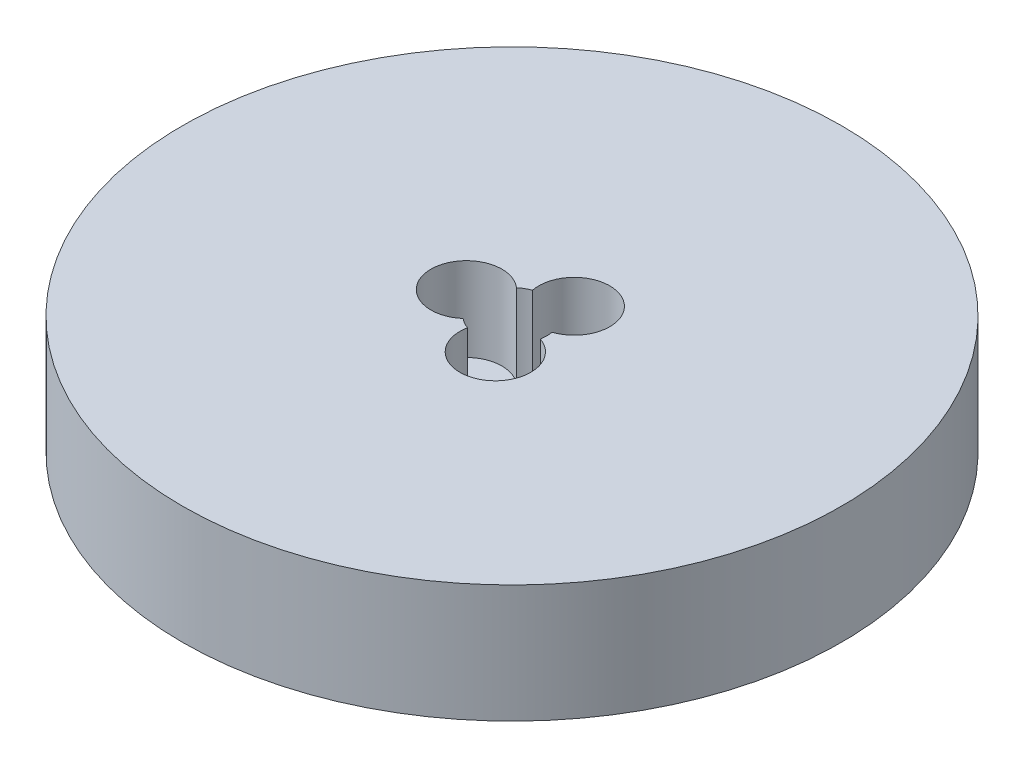
ISO-10303-21;
HEADER;
FILE_DESCRIPTION(('STEP AP214'),'2;1');
FILE_NAME('part.step','',(''),(''),'','','');
FILE_SCHEMA(('AUTOMOTIVE_DESIGN { 1 0 10303 214 1 1 1 1 }'));
ENDSEC;
DATA;
#1=APPLICATION_CONTEXT('core data for automotive mechanical design processes');
#2=APPLICATION_PROTOCOL_DEFINITION('international standard','automotive_design',2000,#1);
#3=PRODUCT_CONTEXT('',#1,'mechanical');
#4=PRODUCT('Part','Part','',(#3));
#5=PRODUCT_RELATED_PRODUCT_CATEGORY('part','',(#4));
#6=PRODUCT_DEFINITION_FORMATION('','',#4);
#7=PRODUCT_DEFINITION_CONTEXT('part definition',#1,'design');
#8=PRODUCT_DEFINITION('design','',#6,#7);
#9=PRODUCT_DEFINITION_SHAPE('','',#8);
#10=(LENGTH_UNIT() NAMED_UNIT(*) SI_UNIT(.MILLI.,.METRE.));
#11=(NAMED_UNIT(*) PLANE_ANGLE_UNIT() SI_UNIT($,.RADIAN.));
#12=(NAMED_UNIT(*) SI_UNIT($,.STERADIAN.) SOLID_ANGLE_UNIT());
#13=UNCERTAINTY_MEASURE_WITH_UNIT(LENGTH_MEASURE(1.E-05),#10,'distance_accuracy_value','');
#14=(GEOMETRIC_REPRESENTATION_CONTEXT(3) GLOBAL_UNCERTAINTY_ASSIGNED_CONTEXT((#13)) GLOBAL_UNIT_ASSIGNED_CONTEXT((#10,
#11,#12)) REPRESENTATION_CONTEXT('',''));
#15=CARTESIAN_POINT('',(0.,0.,0.));
#16=DIRECTION('',(0.,0.,1.));
#17=DIRECTION('',(1.,0.,0.));
#18=AXIS2_PLACEMENT_3D('',#15,#16,#17);
#19=CARTESIAN_POINT('',(0.,17.,0.));
#20=DIRECTION('',(0.,-1.,0.));
#21=DIRECTION('',(0.,0.,-1.));
#22=AXIS2_PLACEMENT_3D('',#19,#20,#21);
#23=CYLINDRICAL_SURFACE('',#22,47.5);
#24=CARTESIAN_POINT('',(0.,17.,0.));
#25=DIRECTION('',(0.,1.,0.));
#26=DIRECTION('',(0.,0.,1.));
#27=AXIS2_PLACEMENT_3D('',#24,#25,#26);
#28=CIRCLE('',#27,47.5);
#29=CARTESIAN_POINT('',(0.,17.,47.5));
#30=VERTEX_POINT('',#29);
#31=EDGE_CURVE('E126',#30,#30,#28,.T.);
#32=ORIENTED_EDGE('',*,*,#31,.F.);
#33=EDGE_LOOP('',(#32));
#34=FACE_BOUND('',#33,.T.);
#35=CARTESIAN_POINT('',(0.,0.,0.));
#36=DIRECTION('',(0.,1.,0.));
#37=DIRECTION('',(0.,0.,1.));
#38=AXIS2_PLACEMENT_3D('',#35,#36,#37);
#39=CIRCLE('',#38,47.5);
#40=CARTESIAN_POINT('',(0.,0.,47.5));
#41=VERTEX_POINT('',#40);
#42=EDGE_CURVE('E124',#41,#41,#39,.T.);
#43=ORIENTED_EDGE('',*,*,#42,.T.);
#44=EDGE_LOOP('',(#43));
#45=FACE_BOUND('',#44,.T.);
#46=ADVANCED_FACE('F39',(#34,#45),#23,.T.);
#47=CARTESIAN_POINT('',(0.,17.,0.));
#48=DIRECTION('',(0.,1.,0.));
#49=DIRECTION('',(0.,0.,1.));
#50=AXIS2_PLACEMENT_3D('',#47,#48,#49);
#51=PLANE('',#50);
#52=CARTESIAN_POINT('',(3.28463833537928,17.,5.68916048136531));
#53=DIRECTION('',(0.,1.,0.));
#54=DIRECTION('',(0.866025403784436,0.,-0.500000000000004));
#55=AXIS2_PLACEMENT_3D('',#52,#53,#54);
#56=CIRCLE('',#55,5.11395543585361);
#57=CARTESIAN_POINT('',(-1.73092532975813,17.,4.69083121661841));
#58=VERTEX_POINT('',#57);
#59=CARTESIAN_POINT('',(4.92784166333568,17.,0.846390300684663));
#60=VERTEX_POINT('',#59);
#61=EDGE_CURVE('E147',#58,#60,#56,.T.);
#62=ORIENTED_EDGE('',*,*,#61,.F.);
#63=CARTESIAN_POINT('',(0.,17.,0.));
#64=DIRECTION('',(0.,1.,0.));
#65=DIRECTION('',(0.,0.,1.));
#66=AXIS2_PLACEMENT_3D('',#63,#64,#65);
#67=CIRCLE('',#66,5.);
#68=CARTESIAN_POINT('',(-3.19691633357752,17.,3.84444091593371));
#69=VERTEX_POINT('',#68);
#70=EDGE_CURVE('E118',#69,#58,#67,.T.);
#71=ORIENTED_EDGE('',*,*,#70,.F.);
#72=CARTESIAN_POINT('',(-6.56927667075851,17.,0.));
#73=DIRECTION('',(0.,1.,0.));
#74=DIRECTION('',(0.,0.,1.));
#75=AXIS2_PLACEMENT_3D('',#72,#73,#74);
#76=CIRCLE('',#75,5.11395543585361);
#77=CARTESIAN_POINT('',(-3.19691633357752,17.,-3.84444091593371));
#78=VERTEX_POINT('',#77);
#79=EDGE_CURVE('E113',#78,#69,#76,.T.);
#80=ORIENTED_EDGE('',*,*,#79,.F.);
#81=CARTESIAN_POINT('',(-1.73092532975819,17.,-4.69083121661838));
#82=VERTEX_POINT('',#81);
#83=EDGE_CURVE('E106',#82,#78,#67,.T.);
#84=ORIENTED_EDGE('',*,*,#83,.F.);
#85=CARTESIAN_POINT('',(3.2846383353792,17.,-5.68916048136536));
#86=DIRECTION('',(0.,1.,0.));
#87=DIRECTION('',(-0.866025403784443,0.,-0.499999999999992));
#88=AXIS2_PLACEMENT_3D('',#85,#86,#87);
#89=CIRCLE('',#88,5.11395543585361);
#90=CARTESIAN_POINT('',(4.92784166333566,17.,-0.84639030068473));
#91=VERTEX_POINT('',#90);
#92=EDGE_CURVE('E90',#91,#82,#89,.T.);
#93=ORIENTED_EDGE('',*,*,#92,.F.);
#94=EDGE_CURVE('E116',#60,#91,#67,.T.);
#95=ORIENTED_EDGE('',*,*,#94,.F.);
#96=EDGE_LOOP('',(#62,#71,#80,#84,#93,#95));
#97=FACE_BOUND('',#96,.T.);
#98=ORIENTED_EDGE('',*,*,#31,.T.);
#99=EDGE_LOOP('',(#98));
#100=FACE_BOUND('',#99,.T.);
#101=ADVANCED_FACE('F115',(#97,#100),#51,.T.);
#102=CARTESIAN_POINT('',(0.,0.,0.));
#103=DIRECTION('',(0.,1.,0.));
#104=DIRECTION('',(0.,0.,1.));
#105=AXIS2_PLACEMENT_3D('',#102,#103,#104);
#106=PLANE('',#105);
#107=CARTESIAN_POINT('',(0.,0.,0.));
#108=DIRECTION('',(0.,1.,0.));
#109=DIRECTION('',(0.,0.,1.));
#110=AXIS2_PLACEMENT_3D('',#107,#108,#109);
#111=CIRCLE('',#110,5.);
#112=CARTESIAN_POINT('',(0.,0.,5.));
#113=VERTEX_POINT('',#112);
#114=EDGE_CURVE('E120',#113,#113,#111,.T.);
#115=ORIENTED_EDGE('',*,*,#114,.T.);
#116=EDGE_LOOP('',(#115));
#117=FACE_BOUND('',#116,.T.);
#118=ORIENTED_EDGE('',*,*,#42,.F.);
#119=EDGE_LOOP('',(#118));
#120=FACE_BOUND('',#119,.T.);
#121=ADVANCED_FACE('F164',(#117,#120),#106,.F.);
#122=CARTESIAN_POINT('',(0.,17.,0.));
#123=DIRECTION('',(0.,-1.,0.));
#124=DIRECTION('',(0.,0.,-1.));
#125=AXIS2_PLACEMENT_3D('',#122,#123,#124);
#126=CYLINDRICAL_SURFACE('',#125,5.);
#127=DIRECTION('',(0.,1.,0.));
#128=VECTOR('',#127,1.);
#129=CARTESIAN_POINT('',(-1.73092532975813,10.9536503220299,4.69083121661841));
#130=LINE('',#129,#128);
#131=CARTESIAN_POINT('',(-1.73092532975813,4.90730064405982,4.69083121661841));
#132=VERTEX_POINT('',#131);
#133=EDGE_CURVE('E11',#132,#58,#130,.T.);
#134=ORIENTED_EDGE('',*,*,#133,.F.);
#135=CARTESIAN_POINT('',(0.,4.90730064405982,0.));
#136=DIRECTION('',(0.,1.,0.));
#137=DIRECTION('',(0.,0.,1.));
#138=AXIS2_PLACEMENT_3D('',#135,#136,#137);
#139=CIRCLE('',#138,5.);
#140=CARTESIAN_POINT('',(4.92784166333568,4.90730064405982,0.846390300684663));
#141=VERTEX_POINT('',#140);
#142=EDGE_CURVE('E144',#132,#141,#139,.T.);
#143=ORIENTED_EDGE('',*,*,#142,.T.);
#144=DIRECTION('',(0.,1.,0.));
#145=VECTOR('',#144,1.);
#146=CARTESIAN_POINT('',(4.92784166333568,10.9536503220299,0.846390300684663));
#147=LINE('',#146,#145);
#148=EDGE_CURVE('E46',#60,#141,#147,.F.);
#149=ORIENTED_EDGE('',*,*,#148,.F.);
#150=ORIENTED_EDGE('',*,*,#94,.T.);
#151=DIRECTION('',(0.,1.,0.));
#152=VECTOR('',#151,1.);
#153=CARTESIAN_POINT('',(4.92784166333566,10.9536503220299,-0.84639030068473));
#154=LINE('',#153,#152);
#155=CARTESIAN_POINT('',(4.92784166333566,4.90730064405982,-0.84639030068473));
#156=VERTEX_POINT('',#155);
#157=EDGE_CURVE('E92',#156,#91,#154,.T.);
#158=ORIENTED_EDGE('',*,*,#157,.F.);
#159=CARTESIAN_POINT('',(0.,4.90730064405982,0.));
#160=DIRECTION('',(0.,1.,0.));
#161=DIRECTION('',(0.,0.,1.));
#162=AXIS2_PLACEMENT_3D('',#159,#160,#161);
#163=CIRCLE('',#162,5.);
#164=CARTESIAN_POINT('',(-1.73092532975819,4.90730064405982,-4.69083121661838));
#165=VERTEX_POINT('',#164);
#166=EDGE_CURVE('E107',#156,#165,#163,.T.);
#167=ORIENTED_EDGE('',*,*,#166,.T.);
#168=DIRECTION('',(0.,1.,0.));
#169=VECTOR('',#168,1.);
#170=CARTESIAN_POINT('',(-1.73092532975819,10.9536503220299,-4.69083121661838));
#171=LINE('',#170,#169);
#172=EDGE_CURVE('E95',#82,#165,#171,.F.);
#173=ORIENTED_EDGE('',*,*,#172,.F.);
#174=ORIENTED_EDGE('',*,*,#83,.T.);
#175=DIRECTION('',(0.,1.,0.));
#176=VECTOR('',#175,1.);
#177=CARTESIAN_POINT('',(-3.19691633357752,10.9536503220299,-3.84444091593371));
#178=LINE('',#177,#176);
#179=CARTESIAN_POINT('',(-3.19691633357752,4.90730064405982,-3.84444091593371));
#180=VERTEX_POINT('',#179);
#181=EDGE_CURVE('E143',#180,#78,#178,.T.);
#182=ORIENTED_EDGE('',*,*,#181,.F.);
#183=CARTESIAN_POINT('',(0.,4.90730064405982,0.));
#184=DIRECTION('',(0.,1.,0.));
#185=DIRECTION('',(0.,0.,1.));
#186=AXIS2_PLACEMENT_3D('',#183,#184,#185);
#187=CIRCLE('',#186,5.);
#188=CARTESIAN_POINT('',(-3.19691633357752,4.90730064405982,3.84444091593371));
#189=VERTEX_POINT('',#188);
#190=EDGE_CURVE('E132',#180,#189,#187,.T.);
#191=ORIENTED_EDGE('',*,*,#190,.T.);
#192=DIRECTION('',(0.,1.,0.));
#193=VECTOR('',#192,1.);
#194=CARTESIAN_POINT('',(-3.19691633357752,10.9536503220299,3.84444091593371));
#195=LINE('',#194,#193);
#196=EDGE_CURVE('E137',#69,#189,#195,.F.);
#197=ORIENTED_EDGE('',*,*,#196,.F.);
#198=ORIENTED_EDGE('',*,*,#70,.T.);
#199=EDGE_LOOP('',(#134,#143,#149,#150,#158,#167,#173,#174,#182,#191,#197,#198));
#200=FACE_BOUND('',#199,.T.);
#201=ORIENTED_EDGE('',*,*,#114,.F.);
#202=EDGE_LOOP('',(#201));
#203=FACE_BOUND('',#202,.T.);
#204=ADVANCED_FACE('F103',(#200,#203),#126,.F.);
#205=CARTESIAN_POINT('',(-6.56927667075851,4.90730064405982,0.));
#206=DIRECTION('',(0.,1.,0.));
#207=DIRECTION('',(0.,0.,1.));
#208=AXIS2_PLACEMENT_3D('',#205,#206,#207);
#209=CYLINDRICAL_SURFACE('',#208,5.11395543585361);
#210=ORIENTED_EDGE('',*,*,#181,.T.);
#211=ORIENTED_EDGE('',*,*,#79,.T.);
#212=ORIENTED_EDGE('',*,*,#196,.T.);
#213=CARTESIAN_POINT('',(-6.56927667075851,4.90730064405982,0.));
#214=DIRECTION('',(0.,1.,0.));
#215=DIRECTION('',(0.,0.,1.));
#216=AXIS2_PLACEMENT_3D('',#213,#214,#215);
#217=CIRCLE('',#216,5.11395543585361);
#218=EDGE_CURVE('E121',#180,#189,#217,.T.);
#219=ORIENTED_EDGE('',*,*,#218,.F.);
#220=EDGE_LOOP('',(#210,#211,#212,#219));
#221=FACE_BOUND('',#220,.T.);
#222=ADVANCED_FACE('F174',(#221),#209,.F.);
#223=CARTESIAN_POINT('',(-6.56927667075851,4.90730064405982,0.));
#224=DIRECTION('',(0.,1.,0.));
#225=DIRECTION('',(0.,0.,1.));
#226=AXIS2_PLACEMENT_3D('',#223,#224,#225);
#227=PLANE('',#226);
#228=ORIENTED_EDGE('',*,*,#218,.T.);
#229=ORIENTED_EDGE('',*,*,#190,.F.);
#230=EDGE_LOOP('',(#228,#229));
#231=FACE_BOUND('',#230,.T.);
#232=ADVANCED_FACE('F177',(#231),#227,.T.);
#233=CARTESIAN_POINT('',(3.2846383353792,4.90730064405982,-5.68916048136536));
#234=DIRECTION('',(0.,1.,0.));
#235=DIRECTION('',(0.,0.,1.));
#236=AXIS2_PLACEMENT_3D('',#233,#234,#235);
#237=CYLINDRICAL_SURFACE('',#236,5.11395543585361);
#238=ORIENTED_EDGE('',*,*,#157,.T.);
#239=ORIENTED_EDGE('',*,*,#92,.T.);
#240=ORIENTED_EDGE('',*,*,#172,.T.);
#241=CARTESIAN_POINT('',(3.2846383353792,4.90730064405982,-5.68916048136536));
#242=DIRECTION('',(0.,1.,0.));
#243=DIRECTION('',(-0.866025403784443,0.,-0.499999999999992));
#244=AXIS2_PLACEMENT_3D('',#241,#242,#243);
#245=CIRCLE('',#244,5.11395543585361);
#246=EDGE_CURVE('E56',#156,#165,#245,.T.);
#247=ORIENTED_EDGE('',*,*,#246,.F.);
#248=EDGE_LOOP('',(#238,#239,#240,#247));
#249=FACE_BOUND('',#248,.T.);
#250=ADVANCED_FACE('F93',(#249),#237,.F.);
#251=CARTESIAN_POINT('',(3.2846383353792,4.90730064405982,-5.68916048136536));
#252=DIRECTION('',(0.,1.,0.));
#253=DIRECTION('',(-0.866025403784443,0.,-0.499999999999992));
#254=AXIS2_PLACEMENT_3D('',#251,#252,#253);
#255=PLANE('',#254);
#256=ORIENTED_EDGE('',*,*,#246,.T.);
#257=ORIENTED_EDGE('',*,*,#166,.F.);
#258=EDGE_LOOP('',(#256,#257));
#259=FACE_BOUND('',#258,.T.);
#260=ADVANCED_FACE('F160',(#259),#255,.T.);
#261=CARTESIAN_POINT('',(3.28463833537928,4.90730064405982,5.68916048136531));
#262=DIRECTION('',(0.,1.,0.));
#263=DIRECTION('',(0.,0.,1.));
#264=AXIS2_PLACEMENT_3D('',#261,#262,#263);
#265=CYLINDRICAL_SURFACE('',#264,5.11395543585361);
#266=ORIENTED_EDGE('',*,*,#133,.T.);
#267=ORIENTED_EDGE('',*,*,#61,.T.);
#268=ORIENTED_EDGE('',*,*,#148,.T.);
#269=CARTESIAN_POINT('',(3.28463833537928,4.90730064405982,5.68916048136531));
#270=DIRECTION('',(0.,1.,0.));
#271=DIRECTION('',(0.866025403784436,0.,-0.500000000000004));
#272=AXIS2_PLACEMENT_3D('',#269,#270,#271);
#273=CIRCLE('',#272,5.11395543585361);
#274=EDGE_CURVE('E55',#132,#141,#273,.T.);
#275=ORIENTED_EDGE('',*,*,#274,.F.);
#276=EDGE_LOOP('',(#266,#267,#268,#275));
#277=FACE_BOUND('',#276,.T.);
#278=ADVANCED_FACE('F149',(#277),#265,.F.);
#279=CARTESIAN_POINT('',(3.28463833537928,4.90730064405982,5.68916048136531));
#280=DIRECTION('',(0.,1.,0.));
#281=DIRECTION('',(0.866025403784436,0.,-0.500000000000004));
#282=AXIS2_PLACEMENT_3D('',#279,#280,#281);
#283=PLANE('',#282);
#284=ORIENTED_EDGE('',*,*,#274,.T.);
#285=ORIENTED_EDGE('',*,*,#142,.F.);
#286=EDGE_LOOP('',(#284,#285));
#287=FACE_BOUND('',#286,.T.);
#288=ADVANCED_FACE('F151',(#287),#283,.T.);
#289=CLOSED_SHELL('',(#46,#101,#121,#204,#222,#232,#250,#260,#278,#288));
#290=MANIFOLD_SOLID_BREP('B2',#289);
#291=ADVANCED_BREP_SHAPE_REPRESENTATION('',(#18,#290),#14);
#292=SHAPE_DEFINITION_REPRESENTATION(#9,#291);
ENDSEC;
END-ISO-10303-21;
